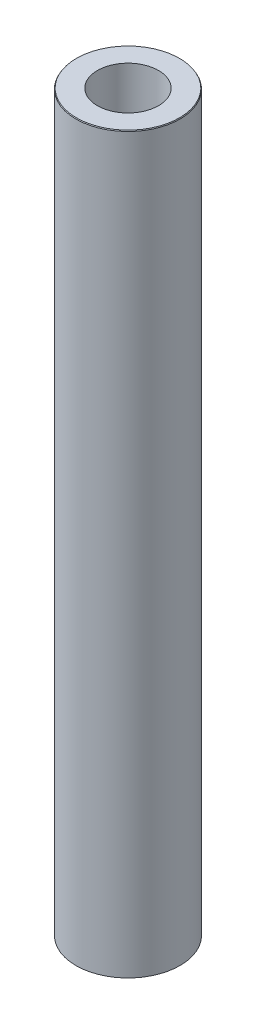
ISO-10303-21;
HEADER;
FILE_DESCRIPTION(('STEP AP214'),'2;1');
FILE_NAME('part.step','',(''),(''),'','','');
FILE_SCHEMA(('AUTOMOTIVE_DESIGN { 1 0 10303 214 1 1 1 1 }'));
ENDSEC;
DATA;
#1=APPLICATION_CONTEXT('core data for automotive mechanical design processes');
#2=APPLICATION_PROTOCOL_DEFINITION('international standard','automotive_design',2000,#1);
#3=PRODUCT_CONTEXT('',#1,'mechanical');
#4=PRODUCT('Part','Part','',(#3));
#5=PRODUCT_RELATED_PRODUCT_CATEGORY('part','',(#4));
#6=PRODUCT_DEFINITION_FORMATION('','',#4);
#7=PRODUCT_DEFINITION_CONTEXT('part definition',#1,'design');
#8=PRODUCT_DEFINITION('design','',#6,#7);
#9=PRODUCT_DEFINITION_SHAPE('','',#8);
#10=(LENGTH_UNIT() NAMED_UNIT(*) SI_UNIT(.MILLI.,.METRE.));
#11=(NAMED_UNIT(*) PLANE_ANGLE_UNIT() SI_UNIT($,.RADIAN.));
#12=(NAMED_UNIT(*) SI_UNIT($,.STERADIAN.) SOLID_ANGLE_UNIT());
#13=UNCERTAINTY_MEASURE_WITH_UNIT(LENGTH_MEASURE(1.E-05),#10,'distance_accuracy_value','');
#14=(GEOMETRIC_REPRESENTATION_CONTEXT(3) GLOBAL_UNCERTAINTY_ASSIGNED_CONTEXT((#13)) GLOBAL_UNIT_ASSIGNED_CONTEXT((#10,
#11,#12)) REPRESENTATION_CONTEXT('',''));
#15=CARTESIAN_POINT('',(0.,0.,0.));
#16=DIRECTION('',(0.,0.,1.));
#17=DIRECTION('',(1.,0.,0.));
#18=AXIS2_PLACEMENT_3D('',#15,#16,#17);
#19=CARTESIAN_POINT('',(0.,600.,0.));
#20=DIRECTION('',(0.,-1.,0.));
#21=DIRECTION('',(0.,0.,-1.));
#22=AXIS2_PLACEMENT_3D('',#19,#20,#21);
#23=CYLINDRICAL_SURFACE('',#22,42.5);
#24=CARTESIAN_POINT('',(0.,599.31297340925,0.));
#25=DIRECTION('',(0.,1.,0.));
#26=DIRECTION('',(0.,0.,1.));
#27=AXIS2_PLACEMENT_3D('',#24,#25,#26);
#28=CIRCLE('',#27,42.5);
#29=CARTESIAN_POINT('',(0.,599.31297340925,42.5));
#30=VERTEX_POINT('',#29);
#31=EDGE_CURVE('E50',#30,#30,#28,.F.);
#32=ORIENTED_EDGE('',*,*,#31,.T.);
#33=EDGE_LOOP('',(#32));
#34=FACE_BOUND('',#33,.T.);
#35=CARTESIAN_POINT('',(0.,0.396654987110057,0.));
#36=DIRECTION('',(0.,1.,0.));
#37=DIRECTION('',(0.,0.,1.));
#38=AXIS2_PLACEMENT_3D('',#35,#36,#37);
#39=CIRCLE('',#38,42.5);
#40=CARTESIAN_POINT('',(0.,0.396654987110057,42.5));
#41=VERTEX_POINT('',#40);
#42=EDGE_CURVE('E51',#41,#41,#39,.T.);
#43=ORIENTED_EDGE('',*,*,#42,.T.);
#44=EDGE_LOOP('',(#43));
#45=FACE_BOUND('',#44,.T.);
#46=ADVANCED_FACE('F39',(#34,#45),#23,.T.);
#47=CARTESIAN_POINT('',(0.,600.,0.));
#48=DIRECTION('',(0.,1.,0.));
#49=DIRECTION('',(0.,0.,1.));
#50=AXIS2_PLACEMENT_3D('',#47,#48,#49);
#51=PLANE('',#50);
#52=CARTESIAN_POINT('',(0.,600.,0.));
#53=DIRECTION('',(0.,1.,0.));
#54=DIRECTION('',(0.,0.,1.));
#55=AXIS2_PLACEMENT_3D('',#52,#53,#54);
#56=CIRCLE('',#55,42.1033450128899);
#57=CARTESIAN_POINT('',(0.,600.,42.1033450128899));
#58=VERTEX_POINT('',#57);
#59=EDGE_CURVE('E54',#58,#58,#56,.T.);
#60=ORIENTED_EDGE('',*,*,#59,.T.);
#61=EDGE_LOOP('',(#60));
#62=FACE_BOUND('',#61,.T.);
#63=CARTESIAN_POINT('',(0.,600.,0.));
#64=DIRECTION('',(0.,1.,0.));
#65=DIRECTION('',(0.,0.,1.));
#66=AXIS2_PLACEMENT_3D('',#63,#64,#65);
#67=CIRCLE('',#66,24.962872680264);
#68=CARTESIAN_POINT('',(0.,600.,24.962872680264));
#69=VERTEX_POINT('',#68);
#70=EDGE_CURVE('E58',#69,#69,#67,.T.);
#71=ORIENTED_EDGE('',*,*,#70,.F.);
#72=EDGE_LOOP('',(#71));
#73=FACE_BOUND('',#72,.T.);
#74=ADVANCED_FACE('F69',(#62,#73),#51,.T.);
#75=CARTESIAN_POINT('',(0.,0.,0.));
#76=DIRECTION('',(0.,1.,0.));
#77=DIRECTION('',(0.,0.,1.));
#78=AXIS2_PLACEMENT_3D('',#75,#76,#77);
#79=PLANE('',#78);
#80=CARTESIAN_POINT('',(0.,0.,0.));
#81=DIRECTION('',(0.,1.,0.));
#82=DIRECTION('',(0.,0.,1.));
#83=AXIS2_PLACEMENT_3D('',#80,#81,#82);
#84=CIRCLE('',#83,41.8129734092498);
#85=CARTESIAN_POINT('',(0.,0.,41.8129734092498));
#86=VERTEX_POINT('',#85);
#87=EDGE_CURVE('E10',#86,#86,#84,.F.);
#88=ORIENTED_EDGE('',*,*,#87,.T.);
#89=EDGE_LOOP('',(#88));
#90=FACE_BOUND('',#89,.T.);
#91=CARTESIAN_POINT('',(0.,0.,0.));
#92=DIRECTION('',(0.,1.,0.));
#93=DIRECTION('',(0.,0.,1.));
#94=AXIS2_PLACEMENT_3D('',#91,#92,#93);
#95=CIRCLE('',#94,24.962872680264);
#96=CARTESIAN_POINT('',(0.,0.,24.962872680264));
#97=VERTEX_POINT('',#96);
#98=EDGE_CURVE('E63',#97,#97,#95,.T.);
#99=ORIENTED_EDGE('',*,*,#98,.T.);
#100=EDGE_LOOP('',(#99));
#101=FACE_BOUND('',#100,.T.);
#102=ADVANCED_FACE('F75',(#90,#101),#79,.F.);
#103=CARTESIAN_POINT('',(0.,600.,0.));
#104=DIRECTION('',(0.,-1.,0.));
#105=DIRECTION('',(0.,0.,-1.));
#106=AXIS2_PLACEMENT_3D('',#103,#104,#105);
#107=CYLINDRICAL_SURFACE('',#106,24.962872680264);
#108=ORIENTED_EDGE('',*,*,#70,.T.);
#109=EDGE_LOOP('',(#108));
#110=FACE_BOUND('',#109,.T.);
#111=ORIENTED_EDGE('',*,*,#98,.F.);
#112=EDGE_LOOP('',(#111));
#113=FACE_BOUND('',#112,.T.);
#114=ADVANCED_FACE('F70',(#110,#113),#107,.F.);
#115=CARTESIAN_POINT('',(0.,600.,0.));
#116=DIRECTION('',(0.,-1.,0.));
#117=DIRECTION('',(0.,0.,-1.));
#118=AXIS2_PLACEMENT_3D('',#115,#116,#117);
#119=CONICAL_SURFACE('',#118,42.1033450128899,0.523598775598288);
#120=ORIENTED_EDGE('',*,*,#31,.F.);
#121=EDGE_LOOP('',(#120));
#122=FACE_BOUND('',#121,.T.);
#123=ORIENTED_EDGE('',*,*,#59,.F.);
#124=EDGE_LOOP('',(#123));
#125=FACE_BOUND('',#124,.T.);
#126=ADVANCED_FACE('F81',(#122,#125),#119,.T.);
#127=CARTESIAN_POINT('',(0.,0.396654987110057,0.));
#128=DIRECTION('',(0.,1.,0.));
#129=DIRECTION('',(0.,0.,1.));
#130=AXIS2_PLACEMENT_3D('',#127,#128,#129);
#131=CONICAL_SURFACE('',#130,42.5,1.04719755119662);
#132=CARTESIAN_POINT('',(0.,0.,41.8129734092498));
#133=CARTESIAN_POINT('',(0.,0.00413182278239777,41.8201299362368));
#134=CARTESIAN_POINT('',(0.,0.00826364556479375,41.8272864632237));
#135=CARTESIAN_POINT('',(0.,0.0165272911295857,41.8415995171977));
#136=CARTESIAN_POINT('',(0.,0.0206591139119817,41.8487560441847));
#137=CARTESIAN_POINT('',(0.,0.0289227594767743,41.8630690981587));
#138=CARTESIAN_POINT('',(0.,0.033054582259171,41.8702256251456));
#139=CARTESIAN_POINT('',(0.,0.0413182278239645,41.8845386791196));
#140=CARTESIAN_POINT('',(0.,0.0454500506063613,41.8916952061066));
#141=CARTESIAN_POINT('',(0.,0.0537136961711537,41.9060082600805));
#142=CARTESIAN_POINT('',(0.,0.0578455189535493,41.9131647870675));
#143=CARTESIAN_POINT('',(0.,0.0661091645183423,41.9274778410415));
#144=CARTESIAN_POINT('',(0.,0.0702409873007396,41.9346343680285));
#145=CARTESIAN_POINT('',(0.,0.0785046328655325,41.9489474220024));
#146=CARTESIAN_POINT('',(0.,0.0826364556479281,41.9561039489894));
#147=CARTESIAN_POINT('',(0.,0.0909001012127205,41.9704170029634));
#148=CARTESIAN_POINT('',(0.,0.0950319239951173,41.9775735299503));
#149=CARTESIAN_POINT('',(0.,0.103295569559911,41.9918865839243));
#150=CARTESIAN_POINT('',(0.,0.107427392342308,41.9990431109113));
#151=CARTESIAN_POINT('',(0.,0.1156910379071,42.0133561648853));
#152=CARTESIAN_POINT('',(0.,0.119822860689496,42.0205126918722));
#153=CARTESIAN_POINT('',(0.,0.128086506254288,42.0348257458462));
#154=CARTESIAN_POINT('',(0.,0.132218329036685,42.0419822728332));
#155=CARTESIAN_POINT('',(0.,0.140481974601479,42.0562953268072));
#156=CARTESIAN_POINT('',(0.,0.144613797383876,42.0634518537941));
#157=CARTESIAN_POINT('',(0.,0.152877442948668,42.0777649077681));
#158=CARTESIAN_POINT('',(0.,0.157009265731063,42.0849214347551));
#159=CARTESIAN_POINT('',(0.,0.165272911295856,42.099234488729));
#160=CARTESIAN_POINT('',(0.,0.169404734078254,42.106391015716));
#161=CARTESIAN_POINT('',(0.,0.177668379643047,42.12070406969));
#162=CARTESIAN_POINT('',(0.,0.181800202425442,42.127860596677));
#163=CARTESIAN_POINT('',(0.,0.190063847990235,42.1421736506509));
#164=CARTESIAN_POINT('',(0.,0.194195670772632,42.1493301776379));
#165=CARTESIAN_POINT('',(0.,0.202459316337425,42.1636432316119));
#166=CARTESIAN_POINT('',(0.,0.206591139119822,42.1707997585989));
#167=CARTESIAN_POINT('',(0.,0.214854784684614,42.1851128125728));
#168=CARTESIAN_POINT('',(0.,0.21898660746701,42.1922693395598));
#169=CARTESIAN_POINT('',(0.,0.227250253031803,42.2065823935338));
#170=CARTESIAN_POINT('',(0.,0.231382075814199,42.2137389205207));
#171=CARTESIAN_POINT('',(0.,0.239645721378993,42.2280519744947));
#172=CARTESIAN_POINT('',(0.,0.24377754416139,42.2352085014817));
#173=CARTESIAN_POINT('',(0.,0.252041189726182,42.2495215554557));
#174=CARTESIAN_POINT('',(0.,0.256173012508578,42.2566780824426));
#175=CARTESIAN_POINT('',(0.,0.264436658073371,42.2709911364166));
#176=CARTESIAN_POINT('',(0.,0.268568480855768,42.2781476634036));
#177=CARTESIAN_POINT('',(0.,0.276832126420561,42.2924607173775));
#178=CARTESIAN_POINT('',(0.,0.280963949202956,42.2996172443645));
#179=CARTESIAN_POINT('',(0.,0.289227594767749,42.3139302983385));
#180=CARTESIAN_POINT('',(0.,0.293359417550146,42.3210868253255));
#181=CARTESIAN_POINT('',(0.,0.301623063114939,42.3353998792994));
#182=CARTESIAN_POINT('',(0.,0.305754885897336,42.3425564062864));
#183=CARTESIAN_POINT('',(0.,0.314018531462128,42.3568694602604));
#184=CARTESIAN_POINT('',(0.,0.318150354244524,42.3640259872474));
#185=CARTESIAN_POINT('',(0.,0.326413999809317,42.3783390412213));
#186=CARTESIAN_POINT('',(0.,0.330545822591714,42.3854955682083));
#187=CARTESIAN_POINT('',(0.,0.338809468156507,42.3998086221823));
#188=CARTESIAN_POINT('',(0.,0.342941290938904,42.4069651491692));
#189=CARTESIAN_POINT('',(0.,0.351204936503696,42.4212782031432));
#190=CARTESIAN_POINT('',(0.,0.355336759286092,42.4284347301302));
#191=CARTESIAN_POINT('',(0.,0.363600404850885,42.4427477841042));
#192=CARTESIAN_POINT('',(0.,0.367732227633282,42.4499043110911));
#193=CARTESIAN_POINT('',(0.,0.375995873198075,42.4642173650651));
#194=CARTESIAN_POINT('',(0.,0.380127695980471,42.4713738920521));
#195=CARTESIAN_POINT('',(0.,0.388391341545263,42.485686946026));
#196=CARTESIAN_POINT('',(0.,0.392523164327659,42.492843473013));
#197=CARTESIAN_POINT('',(0.,0.396654987110057,42.5));
#198=B_SPLINE_CURVE_WITH_KNOTS('',3,(#132,#133,#134,#135,#136,#137,#138,#139,#140,#141,#142,
#143,#144,#145,#146,#147,#148,#149,#150,#151,#152,#153,#154,#155,#156,#157,#158,#159,#160,#161,
#162,#163,#164,#165,#166,#167,#168,#169,#170,#171,#172,#173,#174,#175,#176,#177,#178,#179,#180,
#181,#182,#183,#184,#185,#186,#187,#188,#189,#190,#191,#192,#193,#194,#195,#196,#197),
.UNSPECIFIED.,.F.,.F.,(4,2,2,2,2,2,2,2,2,2,2,2,2,2,2,2,2,2,2,2,2,2,2,2,2,2,2,2,2,2,2,2,4),(0.,
0.0247909366943773,0.0495818733887606,0.0743728100831379,0.0991637467775152,0.123954683471899,
0.148745620166276,0.173536556860659,0.198327493555036,0.223118430249414,0.247909366943797,
0.272700303638174,0.297491240332552,0.322282177026935,0.347073113721312,0.371864050415696,
0.396654987110073,0.42144592380445,0.446236860498833,0.471027797193211,0.495818733887588,
0.520609670581971,0.545400607276349,0.570191543970732,0.59498248066511,0.619773417359487,
0.64456435405387,0.669355290748248,0.694146227442625,0.718937164137008,0.743728100831386,
0.768519037525769,0.793309974220146),.UNSPECIFIED.);
#199=EDGE_CURVE('BSEAM45',#86,#41,#198,.T.);
#200=ORIENTED_EDGE('',*,*,#87,.F.);
#201=ORIENTED_EDGE('',*,*,#42,.F.);
#202=ORIENTED_EDGE('',*,*,#199,.T.);
#203=ORIENTED_EDGE('',*,*,#199,.F.);
#204=EDGE_LOOP('',(#200,#202,#201,#203));
#205=FACE_BOUND('',#204,.T.);
#206=ADVANCED_FACE('F45',(#205),#131,.T.);
#207=CLOSED_SHELL('',(#46,#74,#102,#114,#126,#206));
#208=MANIFOLD_SOLID_BREP('B2',#207);
#209=ADVANCED_BREP_SHAPE_REPRESENTATION('',(#18,#208),#14);
#210=SHAPE_DEFINITION_REPRESENTATION(#9,#209);
ENDSEC;
END-ISO-10303-21;
